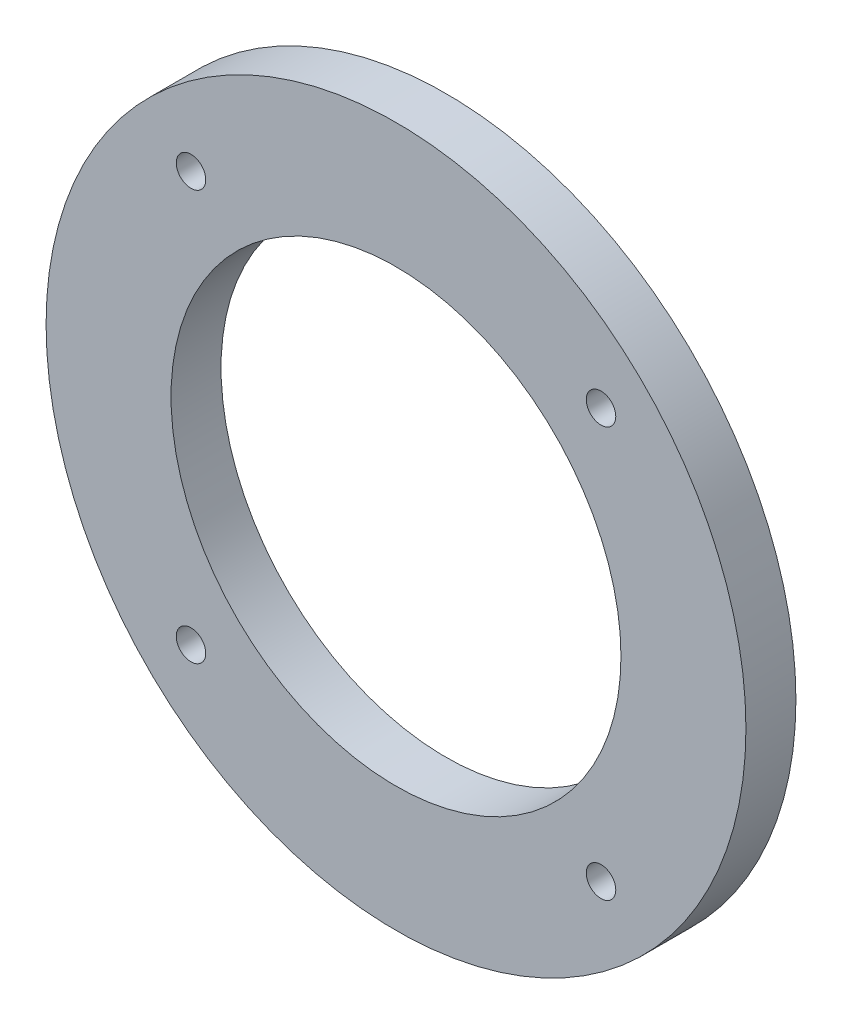
ISO-10303-21;
HEADER;
FILE_DESCRIPTION(('STEP AP214'),'2;1');
FILE_NAME('part.step','',(''),(''),'','','');
FILE_SCHEMA(('AUTOMOTIVE_DESIGN { 1 0 10303 214 1 1 1 1 }'));
ENDSEC;
DATA;
#1=APPLICATION_CONTEXT('core data for automotive mechanical design processes');
#2=APPLICATION_PROTOCOL_DEFINITION('international standard','automotive_design',2000,#1);
#3=PRODUCT_CONTEXT('',#1,'mechanical');
#4=PRODUCT('Part','Part','',(#3));
#5=PRODUCT_RELATED_PRODUCT_CATEGORY('part','',(#4));
#6=PRODUCT_DEFINITION_FORMATION('','',#4);
#7=PRODUCT_DEFINITION_CONTEXT('part definition',#1,'design');
#8=PRODUCT_DEFINITION('design','',#6,#7);
#9=PRODUCT_DEFINITION_SHAPE('','',#8);
#10=(LENGTH_UNIT() NAMED_UNIT(*) SI_UNIT(.MILLI.,.METRE.));
#11=(NAMED_UNIT(*) PLANE_ANGLE_UNIT() SI_UNIT($,.RADIAN.));
#12=(NAMED_UNIT(*) SI_UNIT($,.STERADIAN.) SOLID_ANGLE_UNIT());
#13=UNCERTAINTY_MEASURE_WITH_UNIT(LENGTH_MEASURE(1.E-05),#10,'distance_accuracy_value','');
#14=(GEOMETRIC_REPRESENTATION_CONTEXT(3) GLOBAL_UNCERTAINTY_ASSIGNED_CONTEXT((#13)) GLOBAL_UNIT_ASSIGNED_CONTEXT((#10,
#11,#12)) REPRESENTATION_CONTEXT('',''));
#15=CARTESIAN_POINT('',(0.,0.,0.));
#16=DIRECTION('',(0.,0.,1.));
#17=DIRECTION('',(1.,0.,0.));
#18=AXIS2_PLACEMENT_3D('',#15,#16,#17);
#19=CARTESIAN_POINT('',(0.,0.,5.));
#20=DIRECTION('',(0.,0.,1.));
#21=DIRECTION('',(1.,0.,0.));
#22=AXIS2_PLACEMENT_3D('',#19,#20,#21);
#23=PLANE('',#22);
#24=CARTESIAN_POINT('',(20.5060966544111,-20.5060966544086,5.));
#25=DIRECTION('',(0.,0.,1.));
#26=DIRECTION('',(1.,0.,0.));
#27=AXIS2_PLACEMENT_3D('',#24,#25,#26);
#28=CIRCLE('',#27,1.47500000000163);
#29=CARTESIAN_POINT('',(21.9810966544128,-20.5060966544086,5.));
#30=VERTEX_POINT('',#29);
#31=EDGE_CURVE('E58',#30,#30,#28,.T.);
#32=ORIENTED_EDGE('',*,*,#31,.F.);
#33=EDGE_LOOP('',(#32));
#34=FACE_BOUND('',#33,.T.);
#35=CARTESIAN_POINT('',(-20.50609665441,20.5060966544098,5.));
#36=DIRECTION('',(0.,0.,1.));
#37=DIRECTION('',(1.,0.,0.));
#38=AXIS2_PLACEMENT_3D('',#35,#36,#37);
#39=CIRCLE('',#38,1.475);
#40=CARTESIAN_POINT('',(-19.03109665441,20.5060966544098,5.));
#41=VERTEX_POINT('',#40);
#42=EDGE_CURVE('E46',#41,#41,#39,.T.);
#43=ORIENTED_EDGE('',*,*,#42,.F.);
#44=EDGE_LOOP('',(#43));
#45=FACE_BOUND('',#44,.T.);
#46=CARTESIAN_POINT('',(0.,0.,5.));
#47=DIRECTION('',(0.,0.,1.));
#48=DIRECTION('',(1.,0.,0.));
#49=AXIS2_PLACEMENT_3D('',#46,#47,#48);
#50=CIRCLE('',#49,35.);
#51=CARTESIAN_POINT('',(35.,0.,5.));
#52=VERTEX_POINT('',#51);
#53=EDGE_CURVE('E10',#52,#52,#50,.T.);
#54=ORIENTED_EDGE('',*,*,#53,.T.);
#55=EDGE_LOOP('',(#54));
#56=FACE_BOUND('',#55,.T.);
#57=CARTESIAN_POINT('',(0.,0.,5.));
#58=DIRECTION('',(0.,0.,1.));
#59=DIRECTION('',(1.,0.,0.));
#60=AXIS2_PLACEMENT_3D('',#57,#58,#59);
#61=CIRCLE('',#60,22.5);
#62=CARTESIAN_POINT('',(22.5,0.,5.));
#63=VERTEX_POINT('',#62);
#64=EDGE_CURVE('E41',#63,#63,#61,.T.);
#65=ORIENTED_EDGE('',*,*,#64,.F.);
#66=EDGE_LOOP('',(#65));
#67=FACE_BOUND('',#66,.T.);
#68=CARTESIAN_POINT('',(20.5060966544098,20.5060966544111,5.));
#69=DIRECTION('',(0.,0.,1.));
#70=DIRECTION('',(1.,0.,0.));
#71=AXIS2_PLACEMENT_3D('',#68,#69,#70);
#72=CIRCLE('',#71,1.47500000000119);
#73=CARTESIAN_POINT('',(21.981096654411,20.5060966544111,5.));
#74=VERTEX_POINT('',#73);
#75=EDGE_CURVE('E52',#74,#74,#72,.T.);
#76=ORIENTED_EDGE('',*,*,#75,.F.);
#77=EDGE_LOOP('',(#76));
#78=FACE_BOUND('',#77,.T.);
#79=CARTESIAN_POINT('',(-20.5060966544086,-20.50609665441,5.));
#80=DIRECTION('',(0.,0.,1.));
#81=DIRECTION('',(1.,0.,0.));
#82=AXIS2_PLACEMENT_3D('',#79,#80,#81);
#83=CIRCLE('',#82,1.47500000000061);
#84=CARTESIAN_POINT('',(-19.031096654408,-20.50609665441,5.));
#85=VERTEX_POINT('',#84);
#86=EDGE_CURVE('E64',#85,#85,#83,.T.);
#87=ORIENTED_EDGE('',*,*,#86,.F.);
#88=EDGE_LOOP('',(#87));
#89=FACE_BOUND('',#88,.T.);
#90=ADVANCED_FACE('F30',(#34,#45,#56,#67,#78,#89),#23,.T.);
#91=CARTESIAN_POINT('',(0.,0.,0.));
#92=DIRECTION('',(0.,0.,1.));
#93=DIRECTION('',(1.,0.,0.));
#94=AXIS2_PLACEMENT_3D('',#91,#92,#93);
#95=PLANE('',#94);
#96=CARTESIAN_POINT('',(0.,0.,0.));
#97=DIRECTION('',(0.,0.,1.));
#98=DIRECTION('',(1.,0.,0.));
#99=AXIS2_PLACEMENT_3D('',#96,#97,#98);
#100=CIRCLE('',#99,35.);
#101=CARTESIAN_POINT('',(35.,0.,0.));
#102=VERTEX_POINT('',#101);
#103=EDGE_CURVE('E34',#102,#102,#100,.T.);
#104=ORIENTED_EDGE('',*,*,#103,.F.);
#105=EDGE_LOOP('',(#104));
#106=FACE_BOUND('',#105,.T.);
#107=CARTESIAN_POINT('',(0.,0.,0.));
#108=DIRECTION('',(0.,0.,1.));
#109=DIRECTION('',(1.,0.,0.));
#110=AXIS2_PLACEMENT_3D('',#107,#108,#109);
#111=CIRCLE('',#110,22.5);
#112=CARTESIAN_POINT('',(22.5,0.,0.));
#113=VERTEX_POINT('',#112);
#114=EDGE_CURVE('E43',#113,#113,#111,.T.);
#115=ORIENTED_EDGE('',*,*,#114,.T.);
#116=EDGE_LOOP('',(#115));
#117=FACE_BOUND('',#116,.T.);
#118=CARTESIAN_POINT('',(-20.50609665441,20.5060966544098,0.));
#119=DIRECTION('',(0.,0.,1.));
#120=DIRECTION('',(1.,0.,0.));
#121=AXIS2_PLACEMENT_3D('',#118,#119,#120);
#122=CIRCLE('',#121,1.475);
#123=CARTESIAN_POINT('',(-19.03109665441,20.5060966544098,0.));
#124=VERTEX_POINT('',#123);
#125=EDGE_CURVE('E49',#124,#124,#122,.T.);
#126=ORIENTED_EDGE('',*,*,#125,.T.);
#127=EDGE_LOOP('',(#126));
#128=FACE_BOUND('',#127,.T.);
#129=CARTESIAN_POINT('',(20.5060966544098,20.5060966544111,0.));
#130=DIRECTION('',(0.,0.,1.));
#131=DIRECTION('',(1.,0.,0.));
#132=AXIS2_PLACEMENT_3D('',#129,#130,#131);
#133=CIRCLE('',#132,1.47500000000119);
#134=CARTESIAN_POINT('',(21.981096654411,20.5060966544111,0.));
#135=VERTEX_POINT('',#134);
#136=EDGE_CURVE('E55',#135,#135,#133,.T.);
#137=ORIENTED_EDGE('',*,*,#136,.T.);
#138=EDGE_LOOP('',(#137));
#139=FACE_BOUND('',#138,.T.);
#140=CARTESIAN_POINT('',(20.5060966544111,-20.5060966544086,0.));
#141=DIRECTION('',(0.,0.,1.));
#142=DIRECTION('',(1.,0.,0.));
#143=AXIS2_PLACEMENT_3D('',#140,#141,#142);
#144=CIRCLE('',#143,1.47500000000163);
#145=CARTESIAN_POINT('',(21.9810966544128,-20.5060966544086,0.));
#146=VERTEX_POINT('',#145);
#147=EDGE_CURVE('E61',#146,#146,#144,.T.);
#148=ORIENTED_EDGE('',*,*,#147,.T.);
#149=EDGE_LOOP('',(#148));
#150=FACE_BOUND('',#149,.T.);
#151=CARTESIAN_POINT('',(-20.5060966544086,-20.50609665441,0.));
#152=DIRECTION('',(0.,0.,1.));
#153=DIRECTION('',(1.,0.,0.));
#154=AXIS2_PLACEMENT_3D('',#151,#152,#153);
#155=CIRCLE('',#154,1.47500000000061);
#156=CARTESIAN_POINT('',(-19.031096654408,-20.50609665441,0.));
#157=VERTEX_POINT('',#156);
#158=EDGE_CURVE('E67',#157,#157,#155,.T.);
#159=ORIENTED_EDGE('',*,*,#158,.T.);
#160=EDGE_LOOP('',(#159));
#161=FACE_BOUND('',#160,.T.);
#162=ADVANCED_FACE('F77',(#106,#117,#128,#139,#150,#161),#95,.F.);
#163=CARTESIAN_POINT('',(0.,0.,5.));
#164=DIRECTION('',(0.,0.,-1.));
#165=DIRECTION('',(-1.,0.,0.));
#166=AXIS2_PLACEMENT_3D('',#163,#164,#165);
#167=CYLINDRICAL_SURFACE('',#166,35.);
#168=ORIENTED_EDGE('',*,*,#53,.F.);
#169=EDGE_LOOP('',(#168));
#170=FACE_BOUND('',#169,.T.);
#171=ORIENTED_EDGE('',*,*,#103,.T.);
#172=EDGE_LOOP('',(#171));
#173=FACE_BOUND('',#172,.T.);
#174=ADVANCED_FACE('F32',(#170,#173),#167,.T.);
#175=CARTESIAN_POINT('',(0.,0.,5.));
#176=DIRECTION('',(0.,0.,-1.));
#177=DIRECTION('',(-1.,0.,0.));
#178=AXIS2_PLACEMENT_3D('',#175,#176,#177);
#179=CYLINDRICAL_SURFACE('',#178,22.5);
#180=ORIENTED_EDGE('',*,*,#64,.T.);
#181=EDGE_LOOP('',(#180));
#182=FACE_BOUND('',#181,.T.);
#183=ORIENTED_EDGE('',*,*,#114,.F.);
#184=EDGE_LOOP('',(#183));
#185=FACE_BOUND('',#184,.T.);
#186=ADVANCED_FACE('F87',(#182,#185),#179,.F.);
#187=CARTESIAN_POINT('',(-20.50609665441,20.5060966544098,5.));
#188=DIRECTION('',(0.,0.,-1.));
#189=DIRECTION('',(-1.,0.,0.));
#190=AXIS2_PLACEMENT_3D('',#187,#188,#189);
#191=CYLINDRICAL_SURFACE('',#190,1.475);
#192=ORIENTED_EDGE('',*,*,#42,.T.);
#193=EDGE_LOOP('',(#192));
#194=FACE_BOUND('',#193,.T.);
#195=ORIENTED_EDGE('',*,*,#125,.F.);
#196=EDGE_LOOP('',(#195));
#197=FACE_BOUND('',#196,.T.);
#198=ADVANCED_FACE('F90',(#194,#197),#191,.F.);
#199=CARTESIAN_POINT('',(20.5060966544098,20.5060966544111,5.));
#200=DIRECTION('',(0.,0.,-1.));
#201=DIRECTION('',(-1.,0.,0.));
#202=AXIS2_PLACEMENT_3D('',#199,#200,#201);
#203=CYLINDRICAL_SURFACE('',#202,1.47500000000119);
#204=ORIENTED_EDGE('',*,*,#75,.T.);
#205=EDGE_LOOP('',(#204));
#206=FACE_BOUND('',#205,.T.);
#207=ORIENTED_EDGE('',*,*,#136,.F.);
#208=EDGE_LOOP('',(#207));
#209=FACE_BOUND('',#208,.T.);
#210=ADVANCED_FACE('F94',(#206,#209),#203,.F.);
#211=CARTESIAN_POINT('',(20.5060966544111,-20.5060966544086,5.));
#212=DIRECTION('',(0.,0.,-1.));
#213=DIRECTION('',(-1.,0.,0.));
#214=AXIS2_PLACEMENT_3D('',#211,#212,#213);
#215=CYLINDRICAL_SURFACE('',#214,1.47500000000163);
#216=ORIENTED_EDGE('',*,*,#31,.T.);
#217=EDGE_LOOP('',(#216));
#218=FACE_BOUND('',#217,.T.);
#219=ORIENTED_EDGE('',*,*,#147,.F.);
#220=EDGE_LOOP('',(#219));
#221=FACE_BOUND('',#220,.T.);
#222=ADVANCED_FACE('F98',(#218,#221),#215,.F.);
#223=CARTESIAN_POINT('',(-20.5060966544086,-20.50609665441,5.));
#224=DIRECTION('',(0.,0.,-1.));
#225=DIRECTION('',(-1.,0.,0.));
#226=AXIS2_PLACEMENT_3D('',#223,#224,#225);
#227=CYLINDRICAL_SURFACE('',#226,1.47500000000061);
#228=ORIENTED_EDGE('',*,*,#86,.T.);
#229=EDGE_LOOP('',(#228));
#230=FACE_BOUND('',#229,.T.);
#231=ORIENTED_EDGE('',*,*,#158,.F.);
#232=EDGE_LOOP('',(#231));
#233=FACE_BOUND('',#232,.T.);
#234=ADVANCED_FACE('F73',(#230,#233),#227,.F.);
#235=CLOSED_SHELL('',(#90,#162,#174,#186,#198,#210,#222,#234));
#236=MANIFOLD_SOLID_BREP('B2',#235);
#237=ADVANCED_BREP_SHAPE_REPRESENTATION('',(#18,#236),#14);
#238=SHAPE_DEFINITION_REPRESENTATION(#9,#237);
ENDSEC;
END-ISO-10303-21;
